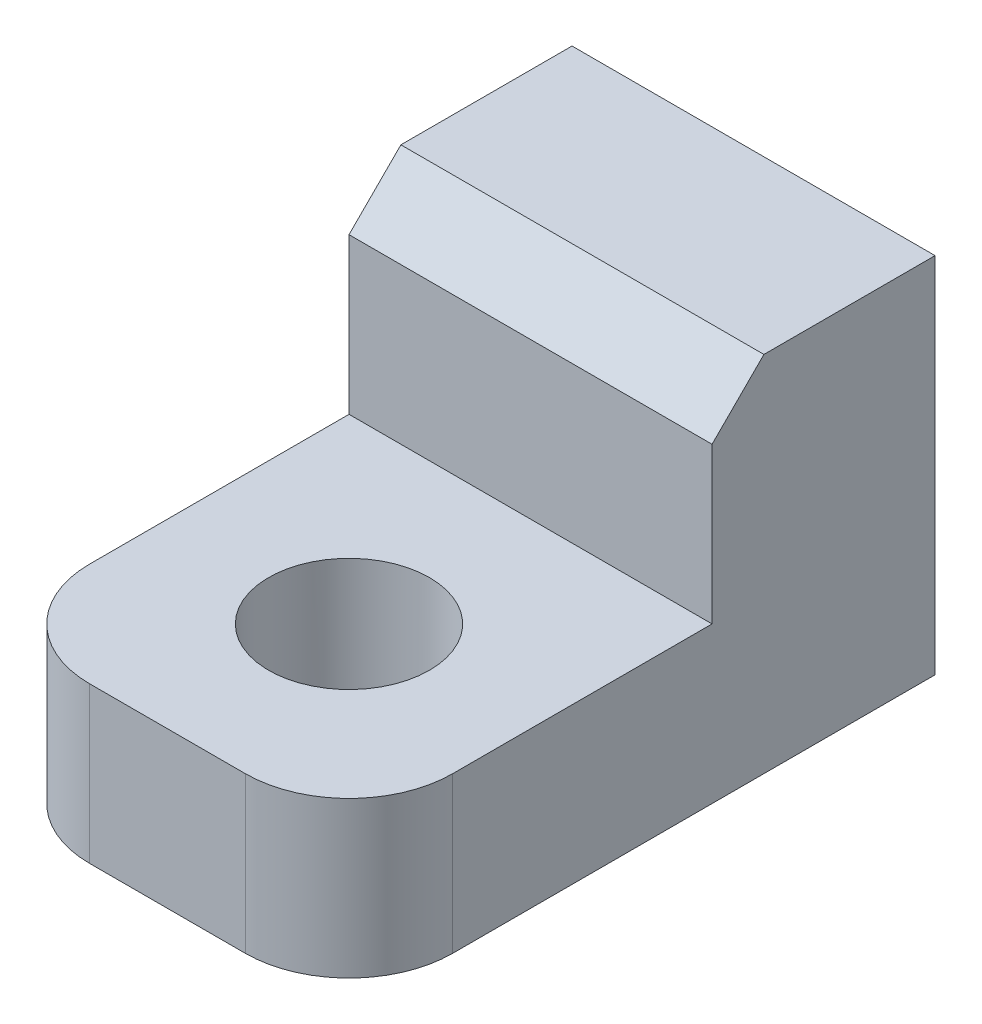
ISO-10303-21;
HEADER;
FILE_DESCRIPTION(('STEP AP214'),'2;1');
FILE_NAME('part.step','',(''),(''),'','','');
FILE_SCHEMA(('AUTOMOTIVE_DESIGN { 1 0 10303 214 1 1 1 1 }'));
ENDSEC;
DATA;
#1=APPLICATION_CONTEXT('core data for automotive mechanical design processes');
#2=APPLICATION_PROTOCOL_DEFINITION('international standard','automotive_design',2000,#1);
#3=PRODUCT_CONTEXT('',#1,'mechanical');
#4=PRODUCT('Part','Part','',(#3));
#5=PRODUCT_RELATED_PRODUCT_CATEGORY('part','',(#4));
#6=PRODUCT_DEFINITION_FORMATION('','',#4);
#7=PRODUCT_DEFINITION_CONTEXT('part definition',#1,'design');
#8=PRODUCT_DEFINITION('design','',#6,#7);
#9=PRODUCT_DEFINITION_SHAPE('','',#8);
#10=(LENGTH_UNIT() NAMED_UNIT(*) SI_UNIT(.MILLI.,.METRE.));
#11=(NAMED_UNIT(*) PLANE_ANGLE_UNIT() SI_UNIT($,.RADIAN.));
#12=(NAMED_UNIT(*) SI_UNIT($,.STERADIAN.) SOLID_ANGLE_UNIT());
#13=UNCERTAINTY_MEASURE_WITH_UNIT(LENGTH_MEASURE(1.E-05),#10,'distance_accuracy_value','');
#14=(GEOMETRIC_REPRESENTATION_CONTEXT(3) GLOBAL_UNCERTAINTY_ASSIGNED_CONTEXT((#13)) GLOBAL_UNIT_ASSIGNED_CONTEXT((#10,
#11,#12)) REPRESENTATION_CONTEXT('',''));
#15=CARTESIAN_POINT('',(0.,0.,0.));
#16=DIRECTION('',(0.,0.,1.));
#17=DIRECTION('',(1.,0.,0.));
#18=AXIS2_PLACEMENT_3D('',#15,#16,#17);
#19=CARTESIAN_POINT('',(0.,0.,4.3));
#20=DIRECTION('',(0.,0.,-1.));
#21=DIRECTION('',(-1.,0.,0.));
#22=AXIS2_PLACEMENT_3D('',#19,#20,#21);
#23=PLANE('',#22);
#24=DIRECTION('',(0.,1.,0.));
#25=VECTOR('',#24,1.);
#26=CARTESIAN_POINT('',(8.49999999999784,10.000000000002,4.3));
#27=LINE('',#26,#25);
#28=CARTESIAN_POINT('',(8.49999999999809,6.00000000000147,4.3));
#29=VERTEX_POINT('',#28);
#30=CARTESIAN_POINT('',(8.49999999999809,9.00000000000201,4.3));
#31=VERTEX_POINT('',#30);
#32=EDGE_CURVE('E110',#29,#31,#27,.T.);
#33=ORIENTED_EDGE('',*,*,#32,.T.);
#34=DIRECTION('',(-1.,0.,0.));
#35=VECTOR('',#34,1.);
#36=CARTESIAN_POINT('',(1.49999999999785,9.000000000002,4.3));
#37=LINE('',#36,#35);
#38=CARTESIAN_POINT('',(1.49999999999809,9.000000000002,4.3));
#39=VERTEX_POINT('',#38);
#40=EDGE_CURVE('E109',#31,#39,#37,.T.);
#41=ORIENTED_EDGE('',*,*,#40,.T.);
#42=DIRECTION('',(0.,-1.,0.));
#43=VECTOR('',#42,1.);
#44=CARTESIAN_POINT('',(1.49999999999827,3.00000000000147,4.3));
#45=LINE('',#44,#43);
#46=CARTESIAN_POINT('',(1.49999999999827,6.00000000000147,4.3));
#47=VERTEX_POINT('',#46);
#48=EDGE_CURVE('E102',#39,#47,#45,.T.);
#49=ORIENTED_EDGE('',*,*,#48,.T.);
#50=DIRECTION('',(-1.,0.,0.));
#51=VECTOR('',#50,1.);
#52=CARTESIAN_POINT('',(1.49999999999827,6.00000000000147,4.3));
#53=LINE('',#52,#51);
#54=EDGE_CURVE('E106',#29,#47,#53,.T.);
#55=ORIENTED_EDGE('',*,*,#54,.F.);
#56=EDGE_LOOP('',(#33,#41,#49,#55));
#57=FACE_BOUND('',#56,.T.);
#58=ADVANCED_FACE('F33',(#57),#23,.F.);
#59=CARTESIAN_POINT('',(8.49999999999827,0.,2.3));
#60=DIRECTION('',(1.,0.,0.));
#61=DIRECTION('',(0.,1.,0.));
#62=AXIS2_PLACEMENT_3D('',#59,#60,#61);
#63=PLANE('',#62);
#64=DIRECTION('',(0.,0.,-1.));
#65=VECTOR('',#64,1.);
#66=CARTESIAN_POINT('',(8.49999999999784,10.000000000002,2.3));
#67=LINE('',#66,#65);
#68=CARTESIAN_POINT('',(8.49999999999806,10.000000000002,3.3));
#69=VERTEX_POINT('',#68);
#70=CARTESIAN_POINT('',(8.49999999999784,10.000000000002,0.));
#71=VERTEX_POINT('',#70);
#72=EDGE_CURVE('E171',#69,#71,#67,.T.);
#73=ORIENTED_EDGE('',*,*,#72,.F.);
#74=DIRECTION('',(0.,-0.707106781186546,0.707106781186549));
#75=VECTOR('',#74,1.);
#76=CARTESIAN_POINT('',(8.49999999999827,5.50000000000102,7.800000000001));
#77=LINE('',#76,#75);
#78=EDGE_CURVE('E11',#69,#31,#77,.T.);
#79=ORIENTED_EDGE('',*,*,#78,.T.);
#80=ORIENTED_EDGE('',*,*,#32,.F.);
#81=DIRECTION('',(0.,0.,-1.));
#82=VECTOR('',#81,1.);
#83=CARTESIAN_POINT('',(8.49999999999827,6.00000000000147,11.3));
#84=LINE('',#83,#82);
#85=CARTESIAN_POINT('',(8.49999999999827,6.00000000000147,9.3));
#86=VERTEX_POINT('',#85);
#87=EDGE_CURVE('E111',#86,#29,#84,.T.);
#88=ORIENTED_EDGE('',*,*,#87,.F.);
#89=DIRECTION('',(0.,1.,0.));
#90=VECTOR('',#89,1.);
#91=CARTESIAN_POINT('',(8.49999999999827,3.00000000000147,9.3));
#92=LINE('',#91,#90);
#93=CARTESIAN_POINT('',(8.49999999999827,3.0000000000014,9.3));
#94=VERTEX_POINT('',#93);
#95=EDGE_CURVE('E157',#86,#94,#92,.F.);
#96=ORIENTED_EDGE('',*,*,#95,.T.);
#97=DIRECTION('',(0.,0.,-1.));
#98=VECTOR('',#97,1.);
#99=CARTESIAN_POINT('',(8.49999999999827,3.0000000000014,2.3));
#100=LINE('',#99,#98);
#101=CARTESIAN_POINT('',(8.49999999999827,3.0000000000014,0.));
#102=VERTEX_POINT('',#101);
#103=EDGE_CURVE('E189',#94,#102,#100,.T.);
#104=ORIENTED_EDGE('',*,*,#103,.T.);
#105=DIRECTION('',(0.,-1.,0.));
#106=VECTOR('',#105,1.);
#107=CARTESIAN_POINT('',(8.49999999999827,0.,0.));
#108=LINE('',#107,#106);
#109=EDGE_CURVE('E203',#71,#102,#108,.T.);
#110=ORIENTED_EDGE('',*,*,#109,.F.);
#111=EDGE_LOOP('',(#73,#79,#80,#88,#96,#104,#110));
#112=FACE_BOUND('',#111,.T.);
#113=ADVANCED_FACE('F204',(#112),#63,.T.);
#114=CARTESIAN_POINT('',(-4.30211422042248E-13,10.000000000002,2.3));
#115=DIRECTION('',(0.,1.,0.));
#116=DIRECTION('',(0.,0.,1.));
#117=AXIS2_PLACEMENT_3D('',#114,#115,#116);
#118=PLANE('',#117);
#119=DIRECTION('',(0.,0.,-1.));
#120=VECTOR('',#119,1.);
#121=CARTESIAN_POINT('',(1.49999999999785,10.000000000002,2.3));
#122=LINE('',#121,#120);
#123=CARTESIAN_POINT('',(1.49999999999785,10.000000000002,3.29999999999999));
#124=VERTEX_POINT('',#123);
#125=CARTESIAN_POINT('',(1.49999999999785,10.000000000002,0.));
#126=VERTEX_POINT('',#125);
#127=EDGE_CURVE('E188',#124,#126,#122,.T.);
#128=ORIENTED_EDGE('',*,*,#127,.F.);
#129=DIRECTION('',(1.,0.,0.));
#130=VECTOR('',#129,1.);
#131=CARTESIAN_POINT('',(8.49999999999784,10.000000000002,3.29999999999999));
#132=LINE('',#131,#130);
#133=EDGE_CURVE('E41',#124,#69,#132,.T.);
#134=ORIENTED_EDGE('',*,*,#133,.T.);
#135=ORIENTED_EDGE('',*,*,#72,.T.);
#136=DIRECTION('',(1.,0.,0.));
#137=VECTOR('',#136,1.);
#138=CARTESIAN_POINT('',(-4.30211422042248E-13,10.000000000002,0.));
#139=LINE('',#138,#137);
#140=EDGE_CURVE('E199',#126,#71,#139,.T.);
#141=ORIENTED_EDGE('',*,*,#140,.F.);
#142=EDGE_LOOP('',(#128,#134,#135,#141));
#143=FACE_BOUND('',#142,.T.);
#144=ADVANCED_FACE('F197',(#143),#118,.T.);
#145=CARTESIAN_POINT('',(1.49999999999827,0.,2.3));
#146=DIRECTION('',(-1.,0.,0.));
#147=DIRECTION('',(0.,0.,1.));
#148=AXIS2_PLACEMENT_3D('',#145,#146,#147);
#149=PLANE('',#148);
#150=ORIENTED_EDGE('',*,*,#48,.F.);
#151=DIRECTION('',(0.,0.707106781186546,-0.707106781186549));
#152=VECTOR('',#151,1.);
#153=CARTESIAN_POINT('',(1.49999999999827,5.50000000000102,7.800000000001));
#154=LINE('',#153,#152);
#155=EDGE_CURVE('E55',#39,#124,#154,.T.);
#156=ORIENTED_EDGE('',*,*,#155,.T.);
#157=ORIENTED_EDGE('',*,*,#127,.T.);
#158=DIRECTION('',(0.,1.,0.));
#159=VECTOR('',#158,1.);
#160=CARTESIAN_POINT('',(1.49999999999827,0.,0.));
#161=LINE('',#160,#159);
#162=CARTESIAN_POINT('',(1.49999999999827,3.00000000000147,0.));
#163=VERTEX_POINT('',#162);
#164=EDGE_CURVE('E187',#163,#126,#161,.T.);
#165=ORIENTED_EDGE('',*,*,#164,.F.);
#166=DIRECTION('',(0.,0.,-1.));
#167=VECTOR('',#166,1.);
#168=CARTESIAN_POINT('',(1.49999999999827,3.00000000000147,2.3));
#169=LINE('',#168,#167);
#170=CARTESIAN_POINT('',(1.49999999999827,3.00000000000147,9.3));
#171=VERTEX_POINT('',#170);
#172=EDGE_CURVE('E183',#171,#163,#169,.T.);
#173=ORIENTED_EDGE('',*,*,#172,.F.);
#174=DIRECTION('',(0.,-1.,0.));
#175=VECTOR('',#174,1.);
#176=CARTESIAN_POINT('',(1.49999999999827,6.00000000000147,9.3));
#177=LINE('',#176,#175);
#178=CARTESIAN_POINT('',(1.49999999999827,6.00000000000147,9.3));
#179=VERTEX_POINT('',#178);
#180=EDGE_CURVE('E118',#171,#179,#177,.F.);
#181=ORIENTED_EDGE('',*,*,#180,.T.);
#182=DIRECTION('',(0.,0.,-1.));
#183=VECTOR('',#182,1.);
#184=CARTESIAN_POINT('',(1.49999999999827,6.00000000000147,11.3));
#185=LINE('',#184,#183);
#186=EDGE_CURVE('E114',#179,#47,#185,.T.);
#187=ORIENTED_EDGE('',*,*,#186,.T.);
#188=EDGE_LOOP('',(#150,#156,#157,#165,#173,#181,#187));
#189=FACE_BOUND('',#188,.T.);
#190=ADVANCED_FACE('F115',(#189),#149,.T.);
#191=CARTESIAN_POINT('',(4.99999999999827,6.49999999999995,2.3));
#192=DIRECTION('',(0.,0.,-1.));
#193=DIRECTION('',(-1.,0.,0.));
#194=AXIS2_PLACEMENT_3D('',#191,#192,#193);
#195=CYLINDRICAL_SURFACE('',#194,1.55);
#196=CARTESIAN_POINT('',(4.99999999999827,6.49999999999995,2.3));
#197=DIRECTION('',(0.,0.,-1.));
#198=DIRECTION('',(-1.,0.,0.));
#199=AXIS2_PLACEMENT_3D('',#196,#197,#198);
#200=CIRCLE('',#199,1.55);
#201=CARTESIAN_POINT('',(3.44999999999827,6.49999999999995,2.3));
#202=VERTEX_POINT('',#201);
#203=EDGE_CURVE('E214',#202,#202,#200,.T.);
#204=ORIENTED_EDGE('',*,*,#203,.F.);
#205=EDGE_LOOP('',(#204));
#206=FACE_BOUND('',#205,.T.);
#207=CARTESIAN_POINT('',(4.99999999999827,6.49999999999995,0.));
#208=DIRECTION('',(0.,0.,1.));
#209=DIRECTION('',(1.,0.,0.));
#210=AXIS2_PLACEMENT_3D('',#207,#208,#209);
#211=CIRCLE('',#210,1.55);
#212=CARTESIAN_POINT('',(6.54999999999827,6.49999999999995,0.));
#213=VERTEX_POINT('',#212);
#214=EDGE_CURVE('E206',#213,#213,#211,.T.);
#215=ORIENTED_EDGE('',*,*,#214,.F.);
#216=EDGE_LOOP('',(#215));
#217=FACE_BOUND('',#216,.T.);
#218=ADVANCED_FACE('F222',(#206,#217),#195,.F.);
#219=CARTESIAN_POINT('',(0.,3.00000000000149,2.3));
#220=DIRECTION('',(0.,1.,0.));
#221=DIRECTION('',(-1.,0.,0.));
#222=AXIS2_PLACEMENT_3D('',#219,#220,#221);
#223=PLANE('',#222);
#224=CARTESIAN_POINT('',(4.99999999999822,3.00000000000144,7.8));
#225=DIRECTION('',(0.,-1.,0.));
#226=DIRECTION('',(1.,0.,0.));
#227=AXIS2_PLACEMENT_3D('',#224,#225,#226);
#228=CIRCLE('',#227,1.55);
#229=CARTESIAN_POINT('',(6.54999999999822,3.00000000000142,7.8));
#230=VERTEX_POINT('',#229);
#231=EDGE_CURVE('E132',#230,#230,#228,.T.);
#232=ORIENTED_EDGE('',*,*,#231,.F.);
#233=EDGE_LOOP('',(#232));
#234=FACE_BOUND('',#233,.T.);
#235=ORIENTED_EDGE('',*,*,#103,.F.);
#236=CARTESIAN_POINT('',(6.49999999999827,3.00000000000142,9.3));
#237=DIRECTION('',(0.,1.,0.));
#238=DIRECTION('',(-1.,0.,0.));
#239=AXIS2_PLACEMENT_3D('',#236,#237,#238);
#240=CIRCLE('',#239,2.);
#241=CARTESIAN_POINT('',(6.49999999999827,3.00000000000147,11.3));
#242=VERTEX_POINT('',#241);
#243=EDGE_CURVE('E151',#94,#242,#240,.F.);
#244=ORIENTED_EDGE('',*,*,#243,.T.);
#245=DIRECTION('',(1.,0.,0.));
#246=VECTOR('',#245,1.);
#247=CARTESIAN_POINT('',(1.49999999999827,3.00000000000147,11.3));
#248=LINE('',#247,#246);
#249=CARTESIAN_POINT('',(3.49999999999827,3.00000000000147,11.3));
#250=VERTEX_POINT('',#249);
#251=EDGE_CURVE('E126',#250,#242,#248,.T.);
#252=ORIENTED_EDGE('',*,*,#251,.F.);
#253=CARTESIAN_POINT('',(3.49999999999827,3.00000000000145,9.3));
#254=DIRECTION('',(0.,1.,0.));
#255=DIRECTION('',(-1.,0.,0.));
#256=AXIS2_PLACEMENT_3D('',#253,#254,#255);
#257=CIRCLE('',#256,2.);
#258=EDGE_CURVE('E152',#250,#171,#257,.F.);
#259=ORIENTED_EDGE('',*,*,#258,.T.);
#260=ORIENTED_EDGE('',*,*,#172,.T.);
#261=DIRECTION('',(1.,0.,0.));
#262=VECTOR('',#261,1.);
#263=CARTESIAN_POINT('',(0.,3.00000000000149,0.));
#264=LINE('',#263,#262);
#265=EDGE_CURVE('E192',#163,#102,#264,.T.);
#266=ORIENTED_EDGE('',*,*,#265,.T.);
#267=EDGE_LOOP('',(#235,#244,#252,#259,#260,#266));
#268=FACE_BOUND('',#267,.T.);
#269=ADVANCED_FACE('F181',(#234,#268),#223,.F.);
#270=CARTESIAN_POINT('',(0.,0.,0.));
#271=DIRECTION('',(0.,0.,1.));
#272=DIRECTION('',(1.,0.,0.));
#273=AXIS2_PLACEMENT_3D('',#270,#271,#272);
#274=PLANE('',#273);
#275=ORIENTED_EDGE('',*,*,#214,.T.);
#276=EDGE_LOOP('',(#275));
#277=FACE_BOUND('',#276,.T.);
#278=ORIENTED_EDGE('',*,*,#109,.T.);
#279=ORIENTED_EDGE('',*,*,#265,.F.);
#280=ORIENTED_EDGE('',*,*,#164,.T.);
#281=ORIENTED_EDGE('',*,*,#140,.T.);
#282=EDGE_LOOP('',(#278,#279,#280,#281));
#283=FACE_BOUND('',#282,.T.);
#284=ADVANCED_FACE('F208',(#277,#283),#274,.F.);
#285=CARTESIAN_POINT('',(0.,0.,2.3));
#286=DIRECTION('',(0.,0.,-1.));
#287=DIRECTION('',(-1.,0.,0.));
#288=AXIS2_PLACEMENT_3D('',#285,#286,#287);
#289=PLANE('',#288);
#290=ORIENTED_EDGE('',*,*,#203,.T.);
#291=EDGE_LOOP('',(#290));
#292=FACE_BOUND('',#291,.T.);
#293=ADVANCED_FACE('F243',(#292),#289,.T.);
#294=CARTESIAN_POINT('',(1.49999999999827,6.00000000000147,11.3));
#295=DIRECTION('',(0.,-1.,0.));
#296=DIRECTION('',(0.,0.,-1.));
#297=AXIS2_PLACEMENT_3D('',#294,#295,#296);
#298=PLANE('',#297);
#299=CARTESIAN_POINT('',(4.99999999999825,6.00000000000147,7.8));
#300=DIRECTION('',(0.,-1.,0.));
#301=DIRECTION('',(0.,0.,-1.));
#302=AXIS2_PLACEMENT_3D('',#299,#300,#301);
#303=CIRCLE('',#302,1.55);
#304=CARTESIAN_POINT('',(4.99999999999825,6.00000000000147,6.25));
#305=VERTEX_POINT('',#304);
#306=EDGE_CURVE('E127',#305,#305,#303,.F.);
#307=ORIENTED_EDGE('',*,*,#306,.F.);
#308=EDGE_LOOP('',(#307));
#309=FACE_BOUND('',#308,.T.);
#310=DIRECTION('',(-1.,0.,0.));
#311=VECTOR('',#310,1.);
#312=CARTESIAN_POINT('',(1.49999999999827,6.00000000000147,11.3));
#313=LINE('',#312,#311);
#314=CARTESIAN_POINT('',(6.49999999999827,6.00000000000147,11.3));
#315=VERTEX_POINT('',#314);
#316=CARTESIAN_POINT('',(3.49999999999827,6.00000000000147,11.3));
#317=VERTEX_POINT('',#316);
#318=EDGE_CURVE('E121',#315,#317,#313,.T.);
#319=ORIENTED_EDGE('',*,*,#318,.F.);
#320=CARTESIAN_POINT('',(6.49999999999827,6.00000000000147,9.3));
#321=DIRECTION('',(0.,-1.,0.));
#322=DIRECTION('',(0.,0.,-1.));
#323=AXIS2_PLACEMENT_3D('',#320,#321,#322);
#324=CIRCLE('',#323,2.);
#325=EDGE_CURVE('E161',#315,#86,#324,.F.);
#326=ORIENTED_EDGE('',*,*,#325,.T.);
#327=ORIENTED_EDGE('',*,*,#87,.T.);
#328=ORIENTED_EDGE('',*,*,#54,.T.);
#329=ORIENTED_EDGE('',*,*,#186,.F.);
#330=CARTESIAN_POINT('',(3.49999999999827,6.00000000000147,9.3));
#331=DIRECTION('',(0.,-1.,0.));
#332=DIRECTION('',(0.,0.,-1.));
#333=AXIS2_PLACEMENT_3D('',#330,#331,#332);
#334=CIRCLE('',#333,2.);
#335=EDGE_CURVE('E163',#179,#317,#334,.F.);
#336=ORIENTED_EDGE('',*,*,#335,.T.);
#337=EDGE_LOOP('',(#319,#326,#327,#328,#329,#336));
#338=FACE_BOUND('',#337,.T.);
#339=ADVANCED_FACE('F124',(#309,#338),#298,.F.);
#340=CARTESIAN_POINT('',(0.,0.,11.3));
#341=DIRECTION('',(0.,0.,-1.));
#342=DIRECTION('',(-1.,0.,0.));
#343=AXIS2_PLACEMENT_3D('',#340,#341,#342);
#344=PLANE('',#343);
#345=ORIENTED_EDGE('',*,*,#251,.T.);
#346=DIRECTION('',(0.,1.,0.));
#347=VECTOR('',#346,1.);
#348=CARTESIAN_POINT('',(6.49999999999827,6.00000000000147,11.3));
#349=LINE('',#348,#347);
#350=EDGE_CURVE('E165',#242,#315,#349,.T.);
#351=ORIENTED_EDGE('',*,*,#350,.T.);
#352=ORIENTED_EDGE('',*,*,#318,.T.);
#353=DIRECTION('',(0.,-1.,0.));
#354=VECTOR('',#353,1.);
#355=CARTESIAN_POINT('',(3.49999999999827,3.00000000000147,11.3));
#356=LINE('',#355,#354);
#357=EDGE_CURVE('E169',#317,#250,#356,.T.);
#358=ORIENTED_EDGE('',*,*,#357,.T.);
#359=EDGE_LOOP('',(#345,#351,#352,#358));
#360=FACE_BOUND('',#359,.T.);
#361=ADVANCED_FACE('F176',(#360),#344,.F.);
#362=CARTESIAN_POINT('',(4.9999999999983,10.001025000002,7.8));
#363=DIRECTION('',(0.,-1.,0.));
#364=DIRECTION('',(1.,0.,0.));
#365=AXIS2_PLACEMENT_3D('',#362,#363,#364);
#366=CYLINDRICAL_SURFACE('',#365,1.55);
#367=ORIENTED_EDGE('',*,*,#231,.T.);
#368=EDGE_LOOP('',(#367));
#369=FACE_BOUND('',#368,.T.);
#370=ORIENTED_EDGE('',*,*,#306,.T.);
#371=EDGE_LOOP('',(#370));
#372=FACE_BOUND('',#371,.T.);
#373=ADVANCED_FACE('F281',(#369,#372),#366,.F.);
#374=CARTESIAN_POINT('',(6.49999999999827,0.,9.3));
#375=DIRECTION('',(0.,-1.,0.));
#376=DIRECTION('',(1.,0.,0.));
#377=AXIS2_PLACEMENT_3D('',#374,#375,#376);
#378=CYLINDRICAL_SURFACE('',#377,2.);
#379=ORIENTED_EDGE('',*,*,#243,.F.);
#380=ORIENTED_EDGE('',*,*,#95,.F.);
#381=ORIENTED_EDGE('',*,*,#325,.F.);
#382=ORIENTED_EDGE('',*,*,#350,.F.);
#383=EDGE_LOOP('',(#379,#380,#381,#382));
#384=FACE_BOUND('',#383,.T.);
#385=ADVANCED_FACE('F213',(#384),#378,.T.);
#386=CARTESIAN_POINT('',(3.49999999999827,0.,9.3));
#387=DIRECTION('',(0.,1.,0.));
#388=DIRECTION('',(0.,0.,1.));
#389=AXIS2_PLACEMENT_3D('',#386,#387,#388);
#390=CYLINDRICAL_SURFACE('',#389,2.);
#391=ORIENTED_EDGE('',*,*,#335,.F.);
#392=ORIENTED_EDGE('',*,*,#180,.F.);
#393=ORIENTED_EDGE('',*,*,#258,.F.);
#394=ORIENTED_EDGE('',*,*,#357,.F.);
#395=EDGE_LOOP('',(#391,#392,#393,#394));
#396=FACE_BOUND('',#395,.T.);
#397=ADVANCED_FACE('F180',(#396),#390,.T.);
#398=CARTESIAN_POINT('',(0.,9.000000000002,4.3));
#399=DIRECTION('',(0.,0.707106781186549,0.707106781186546));
#400=DIRECTION('',(1.,0.,0.));
#401=AXIS2_PLACEMENT_3D('',#398,#399,#400);
#402=PLANE('',#401);
#403=ORIENTED_EDGE('',*,*,#78,.F.);
#404=ORIENTED_EDGE('',*,*,#133,.F.);
#405=ORIENTED_EDGE('',*,*,#155,.F.);
#406=ORIENTED_EDGE('',*,*,#40,.F.);
#407=EDGE_LOOP('',(#403,#404,#405,#406));
#408=FACE_BOUND('',#407,.T.);
#409=ADVANCED_FACE('F35',(#408),#402,.T.);
#410=CLOSED_SHELL('',(#58,#113,#144,#190,#218,#269,#284,#293,#339,#361,#373,#385,#397,#409));
#411=MANIFOLD_SOLID_BREP('B2',#410);
#412=ADVANCED_BREP_SHAPE_REPRESENTATION('',(#18,#411),#14);
#413=SHAPE_DEFINITION_REPRESENTATION(#9,#412);
ENDSEC;
END-ISO-10303-21;
